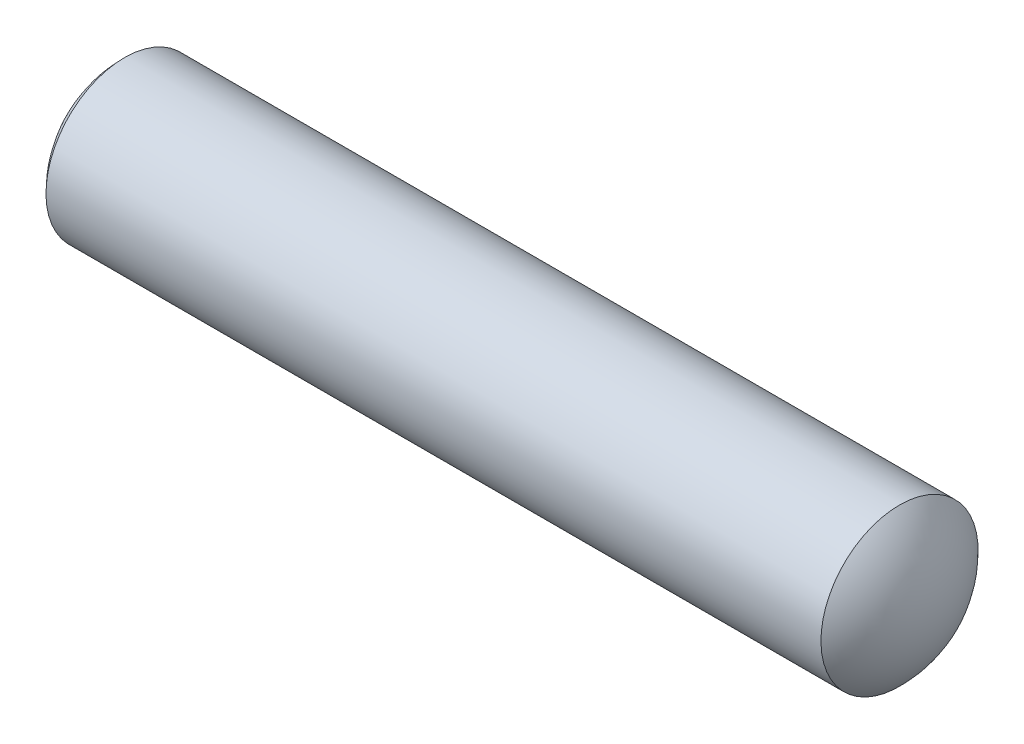
ISO-10303-21;
HEADER;
FILE_DESCRIPTION(('STEP AP214'),'2;1');
FILE_NAME('part.step','',(''),(''),'','','');
FILE_SCHEMA(('AUTOMOTIVE_DESIGN { 1 0 10303 214 1 1 1 1 }'));
ENDSEC;
DATA;
#1=APPLICATION_CONTEXT('core data for automotive mechanical design processes');
#2=APPLICATION_PROTOCOL_DEFINITION('international standard','automotive_design',2000,#1);
#3=PRODUCT_CONTEXT('',#1,'mechanical');
#4=PRODUCT('Part','Part','',(#3));
#5=PRODUCT_RELATED_PRODUCT_CATEGORY('part','',(#4));
#6=PRODUCT_DEFINITION_FORMATION('','',#4);
#7=PRODUCT_DEFINITION_CONTEXT('part definition',#1,'design');
#8=PRODUCT_DEFINITION('design','',#6,#7);
#9=PRODUCT_DEFINITION_SHAPE('','',#8);
#10=(LENGTH_UNIT() NAMED_UNIT(*) SI_UNIT(.MILLI.,.METRE.));
#11=(NAMED_UNIT(*) PLANE_ANGLE_UNIT() SI_UNIT($,.RADIAN.));
#12=(NAMED_UNIT(*) SI_UNIT($,.STERADIAN.) SOLID_ANGLE_UNIT());
#13=UNCERTAINTY_MEASURE_WITH_UNIT(LENGTH_MEASURE(1.E-05),#10,'distance_accuracy_value','');
#14=(GEOMETRIC_REPRESENTATION_CONTEXT(3) GLOBAL_UNCERTAINTY_ASSIGNED_CONTEXT((#13)) GLOBAL_UNIT_ASSIGNED_CONTEXT((#10,
#11,#12)) REPRESENTATION_CONTEXT('',''));
#15=CARTESIAN_POINT('',(0.,0.,0.));
#16=DIRECTION('',(0.,0.,1.));
#17=DIRECTION('',(1.,0.,0.));
#18=AXIS2_PLACEMENT_3D('',#15,#16,#17);
#19=CARTESIAN_POINT('',(15.1875,3.03308499069938,-21.0955694800874));
#20=DIRECTION('',(0.,0.989821441880933,0.142314838273284));
#21=DIRECTION('',(1.,0.,0.));
#22=AXIS2_PLACEMENT_3D('',#19,#20,#21);
#23=SPHERICAL_SURFACE('',#22,1.8375);
#24=CARTESIAN_POINT('',(15.1875,3.03308499069938,-21.0955694800874));
#25=DIRECTION('',(-1.,0.,0.));
#26=DIRECTION('',(0.,-0.142314838273285,0.989821441880933));
#27=AXIS2_PLACEMENT_3D('',#24,#25,#26);
#28=SPHERICAL_SURFACE('',#27,1.8375);
#29=CARTESIAN_POINT('',(16.4734821149612,3.03308499069938,-21.0955694800874));
#30=DIRECTION('',(-1.,0.,0.));
#31=DIRECTION('',(0.,-0.142314838273285,0.989821441880933));
#32=AXIS2_PLACEMENT_3D('',#29,#30,#31);
#33=CIRCLE('',#32,1.3125);
#34=CARTESIAN_POINT('',(16.4734821149612,2.84629676546569,-19.7964288376187));
#35=VERTEX_POINT('',#34);
#36=EDGE_CURVE('E11',#35,#35,#33,.T.);
#37=ORIENTED_EDGE('',*,*,#36,.F.);
#38=EDGE_LOOP('',(#37));
#39=FACE_BOUND('',#38,.T.);
#40=ADVANCED_FACE('F17',(#39),#28,.T.);
#41=CARTESIAN_POINT('',(10.,3.03308499069938,-21.0955694800874));
#42=DIRECTION('',(-1.,0.,0.));
#43=DIRECTION('',(0.,-0.142314838273285,0.989821441880933));
#44=AXIS2_PLACEMENT_3D('',#41,#42,#43);
#45=CYLINDRICAL_SURFACE('',#44,1.3125);
#46=CARTESIAN_POINT('',(3.52651788503884,3.03308499069938,-21.0955694800874));
#47=DIRECTION('',(-1.,0.,0.));
#48=DIRECTION('',(0.,-0.142314838273285,0.989821441880933));
#49=AXIS2_PLACEMENT_3D('',#46,#47,#48);
#50=CIRCLE('',#49,1.3125);
#51=CARTESIAN_POINT('',(3.52651788503884,2.84629676546569,-19.7964288376187));
#52=VERTEX_POINT('',#51);
#53=EDGE_CURVE('E25',#52,#52,#50,.T.);
#54=ORIENTED_EDGE('',*,*,#53,.F.);
#55=EDGE_LOOP('',(#54));
#56=FACE_BOUND('',#55,.T.);
#57=ORIENTED_EDGE('',*,*,#36,.T.);
#58=EDGE_LOOP('',(#57));
#59=FACE_BOUND('',#58,.T.);
#60=ADVANCED_FACE('F47',(#56,#59),#45,.T.);
#61=CARTESIAN_POINT('',(4.8125,3.03308499069938,-21.0955694800874));
#62=DIRECTION('',(0.,0.989821441880933,0.142314838273284));
#63=DIRECTION('',(-1.,0.,0.));
#64=AXIS2_PLACEMENT_3D('',#61,#62,#63);
#65=SPHERICAL_SURFACE('',#64,1.8375);
#66=CARTESIAN_POINT('',(4.8125,3.03308499069938,-21.0955694800874));
#67=DIRECTION('',(-1.,0.,0.));
#68=DIRECTION('',(0.,-0.142314838273285,0.989821441880933));
#69=AXIS2_PLACEMENT_3D('',#66,#67,#68);
#70=SPHERICAL_SURFACE('',#69,1.8375);
#71=ORIENTED_EDGE('',*,*,#53,.T.);
#72=EDGE_LOOP('',(#71));
#73=FACE_BOUND('',#72,.T.);
#74=ADVANCED_FACE('F39',(#73),#70,.T.);
#75=CLOSED_SHELL('',(#40,#60,#74));
#76=MANIFOLD_SOLID_BREP('B1',#75);
#77=ADVANCED_BREP_SHAPE_REPRESENTATION('',(#18,#76),#14);
#78=SHAPE_DEFINITION_REPRESENTATION(#9,#77);
ENDSEC;
END-ISO-10303-21;
